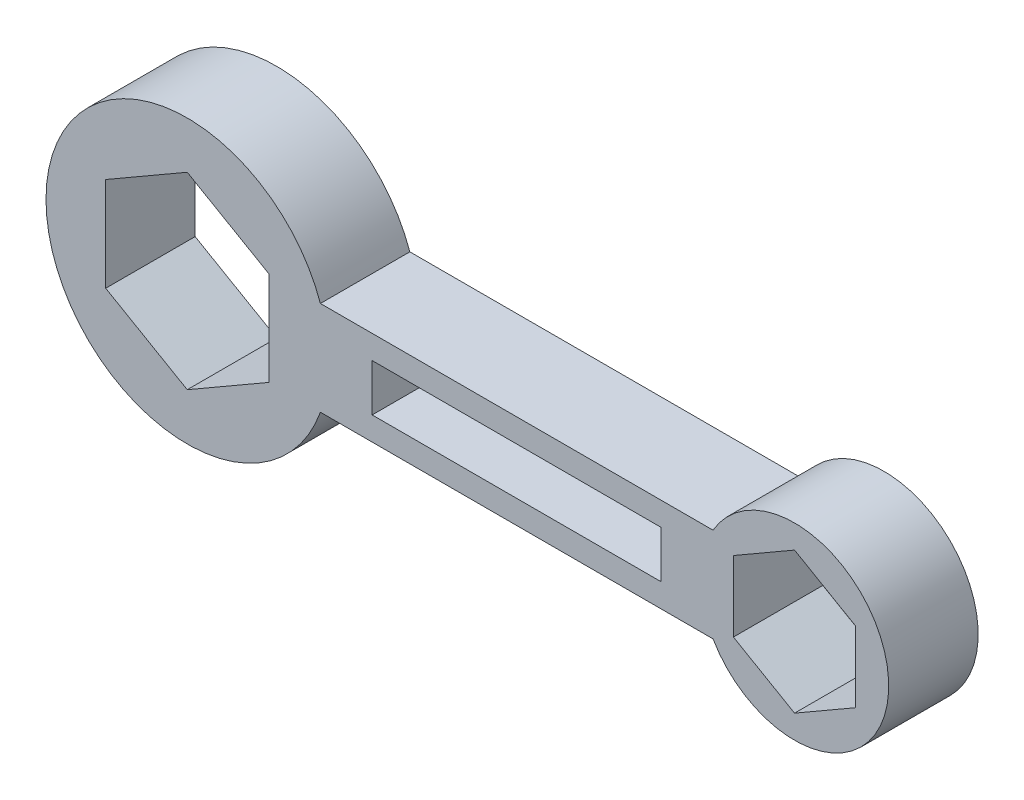
ISO-10303-21;
HEADER;
FILE_DESCRIPTION(('STEP AP214'),'2;1');
FILE_NAME('part.step','',(''),(''),'','','');
FILE_SCHEMA(('AUTOMOTIVE_DESIGN { 1 0 10303 214 1 1 1 1 }'));
ENDSEC;
DATA;
#1=APPLICATION_CONTEXT('core data for automotive mechanical design processes');
#2=APPLICATION_PROTOCOL_DEFINITION('international standard','automotive_design',2000,#1);
#3=PRODUCT_CONTEXT('',#1,'mechanical');
#4=PRODUCT('Part','Part','',(#3));
#5=PRODUCT_RELATED_PRODUCT_CATEGORY('part','',(#4));
#6=PRODUCT_DEFINITION_FORMATION('','',#4);
#7=PRODUCT_DEFINITION_CONTEXT('part definition',#1,'design');
#8=PRODUCT_DEFINITION('design','',#6,#7);
#9=PRODUCT_DEFINITION_SHAPE('','',#8);
#10=(LENGTH_UNIT() NAMED_UNIT(*) SI_UNIT(.MILLI.,.METRE.));
#11=(NAMED_UNIT(*) PLANE_ANGLE_UNIT() SI_UNIT($,.RADIAN.));
#12=(NAMED_UNIT(*) SI_UNIT($,.STERADIAN.) SOLID_ANGLE_UNIT());
#13=UNCERTAINTY_MEASURE_WITH_UNIT(LENGTH_MEASURE(1.E-05),#10,'distance_accuracy_value','');
#14=(GEOMETRIC_REPRESENTATION_CONTEXT(3) GLOBAL_UNCERTAINTY_ASSIGNED_CONTEXT((#13)) GLOBAL_UNIT_ASSIGNED_CONTEXT((#10,
#11,#12)) REPRESENTATION_CONTEXT('',''));
#15=CARTESIAN_POINT('',(0.,0.,0.));
#16=DIRECTION('',(0.,0.,1.));
#17=DIRECTION('',(1.,0.,0.));
#18=AXIS2_PLACEMENT_3D('',#15,#16,#17);
#19=CARTESIAN_POINT('',(-73.3290915102243,-16.3131082037493,19.));
#20=DIRECTION('',(0.,0.,-1.));
#21=DIRECTION('',(-1.,0.,0.));
#22=AXIS2_PLACEMENT_3D('',#19,#20,#21);
#23=CYLINDRICAL_SURFACE('',#22,30.);
#24=CARTESIAN_POINT('',(-73.3290915102243,-16.3131082037493,0.));
#25=DIRECTION('',(0.,0.,1.));
#26=DIRECTION('',(1.,0.,0.));
#27=AXIS2_PLACEMENT_3D('',#24,#25,#26);
#28=CIRCLE('',#27,30.);
#29=CARTESIAN_POINT('',(-45.0448202627624,-6.31310820374927,0.));
#30=VERTEX_POINT('',#29);
#31=CARTESIAN_POINT('',(-45.0448202627624,-26.3131082037493,0.));
#32=VERTEX_POINT('',#31);
#33=EDGE_CURVE('E220',#30,#32,#28,.T.);
#34=ORIENTED_EDGE('',*,*,#33,.T.);
#35=DIRECTION('',(0.,0.,-1.));
#36=VECTOR('',#35,1.);
#37=CARTESIAN_POINT('',(-45.0448202627624,-26.3131082037493,19.));
#38=LINE('',#37,#36);
#39=CARTESIAN_POINT('',(-45.0448202627624,-26.3131082037493,19.));
#40=VERTEX_POINT('',#39);
#41=EDGE_CURVE('E11',#40,#32,#38,.T.);
#42=ORIENTED_EDGE('',*,*,#41,.F.);
#43=CARTESIAN_POINT('',(-73.3290915102243,-16.3131082037493,19.));
#44=DIRECTION('',(0.,0.,1.));
#45=DIRECTION('',(1.,0.,0.));
#46=AXIS2_PLACEMENT_3D('',#43,#44,#45);
#47=CIRCLE('',#46,30.);
#48=CARTESIAN_POINT('',(-45.0448202627624,-6.31310820374927,19.));
#49=VERTEX_POINT('',#48);
#50=EDGE_CURVE('E305',#49,#40,#47,.T.);
#51=ORIENTED_EDGE('',*,*,#50,.F.);
#52=DIRECTION('',(0.,0.,-1.));
#53=VECTOR('',#52,1.);
#54=CARTESIAN_POINT('',(-45.0448202627624,-6.31310820374927,19.));
#55=LINE('',#54,#53);
#56=EDGE_CURVE('E315',#49,#30,#55,.T.);
#57=ORIENTED_EDGE('',*,*,#56,.T.);
#58=EDGE_LOOP('',(#34,#42,#51,#57));
#59=FACE_BOUND('',#58,.T.);
#60=ADVANCED_FACE('F36',(#59),#23,.T.);
#61=CARTESIAN_POINT('',(0.,-26.3131082037493,19.));
#62=DIRECTION('',(0.,-1.,0.));
#63=DIRECTION('',(0.,0.,-1.));
#64=AXIS2_PLACEMENT_3D('',#61,#62,#63);
#65=PLANE('',#64);
#66=DIRECTION('',(-1.,0.,0.));
#67=VECTOR('',#66,1.);
#68=CARTESIAN_POINT('',(0.,-26.3131082037493,0.));
#69=LINE('',#68,#67);
#70=CARTESIAN_POINT('',(38.3504004140869,-26.3131082037493,0.));
#71=VERTEX_POINT('',#70);
#72=EDGE_CURVE('E318',#71,#32,#69,.T.);
#73=ORIENTED_EDGE('',*,*,#72,.F.);
#74=DIRECTION('',(0.,0.,-1.));
#75=VECTOR('',#74,1.);
#76=CARTESIAN_POINT('',(38.3504004140869,-26.3131082037493,19.));
#77=LINE('',#76,#75);
#78=CARTESIAN_POINT('',(38.3504004140869,-26.3131082037493,19.));
#79=VERTEX_POINT('',#78);
#80=EDGE_CURVE('E43',#79,#71,#77,.T.);
#81=ORIENTED_EDGE('',*,*,#80,.F.);
#82=DIRECTION('',(-1.,0.,0.));
#83=VECTOR('',#82,1.);
#84=CARTESIAN_POINT('',(0.,-26.3131082037493,19.));
#85=LINE('',#84,#83);
#86=EDGE_CURVE('E307',#79,#40,#85,.T.);
#87=ORIENTED_EDGE('',*,*,#86,.T.);
#88=ORIENTED_EDGE('',*,*,#41,.T.);
#89=EDGE_LOOP('',(#73,#81,#87,#88));
#90=FACE_BOUND('',#89,.T.);
#91=ADVANCED_FACE('F339',(#90),#65,.T.);
#92=CARTESIAN_POINT('',(55.6709084897757,-16.3131082037493,19.));
#93=DIRECTION('',(0.,0.,-1.));
#94=DIRECTION('',(-1.,0.,0.));
#95=AXIS2_PLACEMENT_3D('',#92,#93,#94);
#96=CYLINDRICAL_SURFACE('',#95,20.);
#97=CARTESIAN_POINT('',(55.6709084897757,-16.3131082037493,0.));
#98=DIRECTION('',(0.,0.,1.));
#99=DIRECTION('',(1.,0.,0.));
#100=AXIS2_PLACEMENT_3D('',#97,#98,#99);
#101=CIRCLE('',#100,20.);
#102=CARTESIAN_POINT('',(38.3504004140869,-6.31310820374927,0.));
#103=VERTEX_POINT('',#102);
#104=EDGE_CURVE('E321',#71,#103,#101,.T.);
#105=ORIENTED_EDGE('',*,*,#104,.T.);
#106=DIRECTION('',(0.,0.,-1.));
#107=VECTOR('',#106,1.);
#108=CARTESIAN_POINT('',(38.3504004140869,-6.31310820374927,19.));
#109=LINE('',#108,#107);
#110=CARTESIAN_POINT('',(38.3504004140869,-6.31310820374927,19.));
#111=VERTEX_POINT('',#110);
#112=EDGE_CURVE('E326',#111,#103,#109,.T.);
#113=ORIENTED_EDGE('',*,*,#112,.F.);
#114=CARTESIAN_POINT('',(55.6709084897757,-16.3131082037493,19.));
#115=DIRECTION('',(0.,0.,1.));
#116=DIRECTION('',(1.,0.,0.));
#117=AXIS2_PLACEMENT_3D('',#114,#115,#116);
#118=CIRCLE('',#117,20.);
#119=EDGE_CURVE('E311',#79,#111,#118,.T.);
#120=ORIENTED_EDGE('',*,*,#119,.F.);
#121=ORIENTED_EDGE('',*,*,#80,.T.);
#122=EDGE_LOOP('',(#105,#113,#120,#121));
#123=FACE_BOUND('',#122,.T.);
#124=ADVANCED_FACE('F331',(#123),#96,.T.);
#125=CARTESIAN_POINT('',(0.,-6.31310820374927,19.));
#126=DIRECTION('',(0.,-1.,0.));
#127=DIRECTION('',(0.,0.,-1.));
#128=AXIS2_PLACEMENT_3D('',#125,#126,#127);
#129=PLANE('',#128);
#130=DIRECTION('',(-1.,0.,0.));
#131=VECTOR('',#130,1.);
#132=CARTESIAN_POINT('',(0.,-6.31310820374927,0.));
#133=LINE('',#132,#131);
#134=EDGE_CURVE('E308',#103,#30,#133,.T.);
#135=ORIENTED_EDGE('',*,*,#134,.T.);
#136=ORIENTED_EDGE('',*,*,#56,.F.);
#137=DIRECTION('',(-1.,0.,0.));
#138=VECTOR('',#137,1.);
#139=CARTESIAN_POINT('',(0.,-6.31310820374927,19.));
#140=LINE('',#139,#138);
#141=EDGE_CURVE('E313',#111,#49,#140,.T.);
#142=ORIENTED_EDGE('',*,*,#141,.F.);
#143=ORIENTED_EDGE('',*,*,#112,.T.);
#144=EDGE_LOOP('',(#135,#136,#142,#143));
#145=FACE_BOUND('',#144,.T.);
#146=ADVANCED_FACE('F346',(#145),#129,.F.);
#147=CARTESIAN_POINT('',(0.,0.,19.));
#148=DIRECTION('',(0.,0.,1.));
#149=DIRECTION('',(1.,0.,0.));
#150=AXIS2_PLACEMENT_3D('',#147,#148,#149);
#151=PLANE('',#150);
#152=DIRECTION('',(-0.866025403784439,0.5,0.));
#153=VECTOR('',#152,1.);
#154=CARTESIAN_POINT('',(-56.0085834345356,-6.31310820374927,19.));
#155=LINE('',#154,#153);
#156=CARTESIAN_POINT('',(-56.0085834345356,-6.31310820374927,19.));
#157=VERTEX_POINT('',#156);
#158=CARTESIAN_POINT('',(-73.3290915102243,3.68689179625073,19.));
#159=VERTEX_POINT('',#158);
#160=EDGE_CURVE('E50',#157,#159,#155,.T.);
#161=ORIENTED_EDGE('',*,*,#160,.F.);
#162=DIRECTION('',(0.,1.,0.));
#163=VECTOR('',#162,1.);
#164=CARTESIAN_POINT('',(-56.0085834345356,-26.3131082037493,19.));
#165=LINE('',#164,#163);
#166=CARTESIAN_POINT('',(-56.0085834345356,-26.3131082037493,19.));
#167=VERTEX_POINT('',#166);
#168=EDGE_CURVE('E193',#167,#157,#165,.T.);
#169=ORIENTED_EDGE('',*,*,#168,.F.);
#170=DIRECTION('',(0.866025403784439,0.5,0.));
#171=VECTOR('',#170,1.);
#172=CARTESIAN_POINT('',(-73.3290915102243,-36.3131082037493,19.));
#173=LINE('',#172,#171);
#174=CARTESIAN_POINT('',(-73.3290915102243,-36.3131082037493,19.));
#175=VERTEX_POINT('',#174);
#176=EDGE_CURVE('E196',#175,#167,#173,.T.);
#177=ORIENTED_EDGE('',*,*,#176,.F.);
#178=DIRECTION('',(0.866025403784439,-0.5,0.));
#179=VECTOR('',#178,1.);
#180=CARTESIAN_POINT('',(-90.6495995859131,-26.3131082037493,19.));
#181=LINE('',#180,#179);
#182=CARTESIAN_POINT('',(-90.6495995859131,-26.3131082037493,19.));
#183=VERTEX_POINT('',#182);
#184=EDGE_CURVE('E213',#183,#175,#181,.T.);
#185=ORIENTED_EDGE('',*,*,#184,.F.);
#186=DIRECTION('',(0.,-1.,0.));
#187=VECTOR('',#186,1.);
#188=CARTESIAN_POINT('',(-90.6495995859131,-6.31310820374927,19.));
#189=LINE('',#188,#187);
#190=CARTESIAN_POINT('',(-90.6495995859131,-6.31310820374927,19.));
#191=VERTEX_POINT('',#190);
#192=EDGE_CURVE('E210',#191,#183,#189,.T.);
#193=ORIENTED_EDGE('',*,*,#192,.F.);
#194=DIRECTION('',(-0.866025403784439,-0.5,0.));
#195=VECTOR('',#194,1.);
#196=CARTESIAN_POINT('',(-73.3290915102243,3.68689179625073,19.));
#197=LINE('',#196,#195);
#198=EDGE_CURVE('E207',#159,#191,#197,.T.);
#199=ORIENTED_EDGE('',*,*,#198,.F.);
#200=EDGE_LOOP('',(#161,#169,#177,#185,#193,#199));
#201=FACE_BOUND('',#200,.T.);
#202=DIRECTION('',(-0.866025403784439,0.5,0.));
#203=VECTOR('',#202,1.);
#204=CARTESIAN_POINT('',(68.6612895465422,-8.81310820374926,19.));
#205=LINE('',#204,#203);
#206=CARTESIAN_POINT('',(68.6612895465422,-8.81310820374926,19.));
#207=VERTEX_POINT('',#206);
#208=CARTESIAN_POINT('',(55.6709084897757,-1.31310820374927,19.));
#209=VERTEX_POINT('',#208);
#210=EDGE_CURVE('E58',#207,#209,#205,.T.);
#211=ORIENTED_EDGE('',*,*,#210,.F.);
#212=DIRECTION('',(0.,1.,0.));
#213=VECTOR('',#212,1.);
#214=CARTESIAN_POINT('',(68.6612895465422,-23.8131082037493,19.));
#215=LINE('',#214,#213);
#216=CARTESIAN_POINT('',(68.6612895465422,-23.8131082037493,19.));
#217=VERTEX_POINT('',#216);
#218=EDGE_CURVE('E232',#217,#207,#215,.T.);
#219=ORIENTED_EDGE('',*,*,#218,.F.);
#220=DIRECTION('',(0.866025403784438,0.5,0.));
#221=VECTOR('',#220,1.);
#222=CARTESIAN_POINT('',(55.6709084897757,-31.3131082037493,19.));
#223=LINE('',#222,#221);
#224=CARTESIAN_POINT('',(55.6709084897757,-31.3131082037493,19.));
#225=VERTEX_POINT('',#224);
#226=EDGE_CURVE('E259',#225,#217,#223,.T.);
#227=ORIENTED_EDGE('',*,*,#226,.F.);
#228=DIRECTION('',(0.866025403784438,-0.5,0.));
#229=VECTOR('',#228,1.);
#230=CARTESIAN_POINT('',(42.6805274330091,-23.8131082037493,19.));
#231=LINE('',#230,#229);
#232=CARTESIAN_POINT('',(42.6805274330091,-23.8131082037493,19.));
#233=VERTEX_POINT('',#232);
#234=EDGE_CURVE('E256',#233,#225,#231,.T.);
#235=ORIENTED_EDGE('',*,*,#234,.F.);
#236=DIRECTION('',(0.,-1.,0.));
#237=VECTOR('',#236,1.);
#238=CARTESIAN_POINT('',(42.6805274330091,-8.81310820374927,19.));
#239=LINE('',#238,#237);
#240=CARTESIAN_POINT('',(42.6805274330091,-8.81310820374927,19.));
#241=VERTEX_POINT('',#240);
#242=EDGE_CURVE('E253',#241,#233,#239,.T.);
#243=ORIENTED_EDGE('',*,*,#242,.F.);
#244=DIRECTION('',(-0.866025403784438,-0.5,0.));
#245=VECTOR('',#244,1.);
#246=CARTESIAN_POINT('',(55.6709084897757,-1.31310820374927,19.));
#247=LINE('',#246,#245);
#248=EDGE_CURVE('E249',#209,#241,#247,.T.);
#249=ORIENTED_EDGE('',*,*,#248,.F.);
#250=EDGE_LOOP('',(#211,#219,#227,#235,#243,#249));
#251=FACE_BOUND('',#250,.T.);
#252=DIRECTION('',(0.,-1.,0.));
#253=VECTOR('',#252,1.);
#254=CARTESIAN_POINT('',(-34.0448202627624,-11.3131082037493,19.));
#255=LINE('',#254,#253);
#256=CARTESIAN_POINT('',(-34.0448202627624,-11.3131082037493,19.));
#257=VERTEX_POINT('',#256);
#258=CARTESIAN_POINT('',(-34.0448202627624,-21.3131082037493,19.));
#259=VERTEX_POINT('',#258);
#260=EDGE_CURVE('E288',#257,#259,#255,.T.);
#261=ORIENTED_EDGE('',*,*,#260,.F.);
#262=DIRECTION('',(-1.,0.,0.));
#263=VECTOR('',#262,1.);
#264=CARTESIAN_POINT('',(-34.0448202627624,-11.3131082037493,19.));
#265=LINE('',#264,#263);
#266=CARTESIAN_POINT('',(27.3504004140869,-11.3131082037493,19.));
#267=VERTEX_POINT('',#266);
#268=EDGE_CURVE('E278',#267,#257,#265,.T.);
#269=ORIENTED_EDGE('',*,*,#268,.F.);
#270=DIRECTION('',(0.,1.,0.));
#271=VECTOR('',#270,1.);
#272=CARTESIAN_POINT('',(27.3504004140869,-11.3131082037493,19.));
#273=LINE('',#272,#271);
#274=CARTESIAN_POINT('',(27.3504004140869,-21.3131082037493,19.));
#275=VERTEX_POINT('',#274);
#276=EDGE_CURVE('E293',#275,#267,#273,.T.);
#277=ORIENTED_EDGE('',*,*,#276,.F.);
#278=DIRECTION('',(1.,0.,0.));
#279=VECTOR('',#278,1.);
#280=CARTESIAN_POINT('',(-34.0448202627624,-21.3131082037493,19.));
#281=LINE('',#280,#279);
#282=EDGE_CURVE('E290',#259,#275,#281,.T.);
#283=ORIENTED_EDGE('',*,*,#282,.F.);
#284=EDGE_LOOP('',(#261,#269,#277,#283));
#285=FACE_BOUND('',#284,.T.);
#286=ORIENTED_EDGE('',*,*,#50,.T.);
#287=ORIENTED_EDGE('',*,*,#86,.F.);
#288=ORIENTED_EDGE('',*,*,#119,.T.);
#289=ORIENTED_EDGE('',*,*,#141,.T.);
#290=EDGE_LOOP('',(#286,#287,#288,#289));
#291=FACE_BOUND('',#290,.T.);
#292=ADVANCED_FACE('F348',(#201,#251,#285,#291),#151,.T.);
#293=CARTESIAN_POINT('',(0.,0.,0.));
#294=DIRECTION('',(0.,0.,1.));
#295=DIRECTION('',(1.,0.,0.));
#296=AXIS2_PLACEMENT_3D('',#293,#294,#295);
#297=PLANE('',#296);
#298=DIRECTION('',(0.,1.,0.));
#299=VECTOR('',#298,1.);
#300=CARTESIAN_POINT('',(-56.0085834345356,-26.3131082037493,0.));
#301=LINE('',#300,#299);
#302=CARTESIAN_POINT('',(-56.0085834345356,-26.3131082037493,0.));
#303=VERTEX_POINT('',#302);
#304=CARTESIAN_POINT('',(-56.0085834345356,-6.31310820374927,0.));
#305=VERTEX_POINT('',#304);
#306=EDGE_CURVE('E179',#303,#305,#301,.T.);
#307=ORIENTED_EDGE('',*,*,#306,.T.);
#308=DIRECTION('',(-0.866025403784439,0.5,0.));
#309=VECTOR('',#308,1.);
#310=CARTESIAN_POINT('',(-56.0085834345356,-6.31310820374927,0.));
#311=LINE('',#310,#309);
#312=CARTESIAN_POINT('',(-73.3290915102243,3.68689179625073,0.));
#313=VERTEX_POINT('',#312);
#314=EDGE_CURVE('E173',#305,#313,#311,.T.);
#315=ORIENTED_EDGE('',*,*,#314,.T.);
#316=DIRECTION('',(-0.866025403784439,-0.5,0.));
#317=VECTOR('',#316,1.);
#318=CARTESIAN_POINT('',(-73.3290915102243,3.68689179625073,0.));
#319=LINE('',#318,#317);
#320=CARTESIAN_POINT('',(-90.6495995859131,-6.31310820374927,0.));
#321=VERTEX_POINT('',#320);
#322=EDGE_CURVE('E183',#313,#321,#319,.T.);
#323=ORIENTED_EDGE('',*,*,#322,.T.);
#324=DIRECTION('',(0.,-1.,0.));
#325=VECTOR('',#324,1.);
#326=CARTESIAN_POINT('',(-90.6495995859131,-6.31310820374927,0.));
#327=LINE('',#326,#325);
#328=CARTESIAN_POINT('',(-90.6495995859131,-26.3131082037493,0.));
#329=VERTEX_POINT('',#328);
#330=EDGE_CURVE('E187',#321,#329,#327,.T.);
#331=ORIENTED_EDGE('',*,*,#330,.T.);
#332=DIRECTION('',(0.866025403784439,-0.5,0.));
#333=VECTOR('',#332,1.);
#334=CARTESIAN_POINT('',(-90.6495995859131,-26.3131082037493,0.));
#335=LINE('',#334,#333);
#336=CARTESIAN_POINT('',(-73.3290915102243,-36.3131082037493,0.));
#337=VERTEX_POINT('',#336);
#338=EDGE_CURVE('E200',#329,#337,#335,.T.);
#339=ORIENTED_EDGE('',*,*,#338,.T.);
#340=DIRECTION('',(0.866025403784439,0.5,0.));
#341=VECTOR('',#340,1.);
#342=CARTESIAN_POINT('',(-73.3290915102243,-36.3131082037493,0.));
#343=LINE('',#342,#341);
#344=EDGE_CURVE('E203',#337,#303,#343,.T.);
#345=ORIENTED_EDGE('',*,*,#344,.T.);
#346=EDGE_LOOP('',(#307,#315,#323,#331,#339,#345));
#347=FACE_BOUND('',#346,.T.);
#348=DIRECTION('',(0.,1.,0.));
#349=VECTOR('',#348,1.);
#350=CARTESIAN_POINT('',(68.6612895465422,-23.8131082037493,0.));
#351=LINE('',#350,#349);
#352=CARTESIAN_POINT('',(68.6612895465422,-23.8131082037493,0.));
#353=VERTEX_POINT('',#352);
#354=CARTESIAN_POINT('',(68.6612895465422,-8.81310820374926,0.));
#355=VERTEX_POINT('',#354);
#356=EDGE_CURVE('E244',#353,#355,#351,.T.);
#357=ORIENTED_EDGE('',*,*,#356,.T.);
#358=DIRECTION('',(-0.866025403784439,0.5,0.));
#359=VECTOR('',#358,1.);
#360=CARTESIAN_POINT('',(68.6612895465422,-8.81310820374926,0.));
#361=LINE('',#360,#359);
#362=CARTESIAN_POINT('',(55.6709084897757,-1.31310820374927,0.));
#363=VERTEX_POINT('',#362);
#364=EDGE_CURVE('E228',#355,#363,#361,.T.);
#365=ORIENTED_EDGE('',*,*,#364,.T.);
#366=DIRECTION('',(-0.866025403784438,-0.5,0.));
#367=VECTOR('',#366,1.);
#368=CARTESIAN_POINT('',(55.6709084897757,-1.31310820374927,0.));
#369=LINE('',#368,#367);
#370=CARTESIAN_POINT('',(42.6805274330091,-8.81310820374928,0.));
#371=VERTEX_POINT('',#370);
#372=EDGE_CURVE('E231',#363,#371,#369,.T.);
#373=ORIENTED_EDGE('',*,*,#372,.T.);
#374=DIRECTION('',(0.,-1.,0.));
#375=VECTOR('',#374,1.);
#376=CARTESIAN_POINT('',(42.6805274330091,-8.81310820374927,0.));
#377=LINE('',#376,#375);
#378=CARTESIAN_POINT('',(42.6805274330091,-23.8131082037493,0.));
#379=VERTEX_POINT('',#378);
#380=EDGE_CURVE('E235',#371,#379,#377,.T.);
#381=ORIENTED_EDGE('',*,*,#380,.T.);
#382=DIRECTION('',(0.866025403784438,-0.5,0.));
#383=VECTOR('',#382,1.);
#384=CARTESIAN_POINT('',(42.6805274330091,-23.8131082037493,0.));
#385=LINE('',#384,#383);
#386=CARTESIAN_POINT('',(55.6709084897757,-31.3131082037493,0.));
#387=VERTEX_POINT('',#386);
#388=EDGE_CURVE('E238',#379,#387,#385,.T.);
#389=ORIENTED_EDGE('',*,*,#388,.T.);
#390=DIRECTION('',(0.866025403784438,0.5,0.));
#391=VECTOR('',#390,1.);
#392=CARTESIAN_POINT('',(55.6709084897757,-31.3131082037493,0.));
#393=LINE('',#392,#391);
#394=EDGE_CURVE('E241',#387,#353,#393,.T.);
#395=ORIENTED_EDGE('',*,*,#394,.T.);
#396=EDGE_LOOP('',(#357,#365,#373,#381,#389,#395));
#397=FACE_BOUND('',#396,.T.);
#398=DIRECTION('',(-1.,0.,0.));
#399=VECTOR('',#398,1.);
#400=CARTESIAN_POINT('',(-34.0448202627624,-11.3131082037493,0.));
#401=LINE('',#400,#399);
#402=CARTESIAN_POINT('',(27.3504004140869,-11.3131082037493,0.));
#403=VERTEX_POINT('',#402);
#404=CARTESIAN_POINT('',(-34.0448202627624,-11.3131082037493,0.));
#405=VERTEX_POINT('',#404);
#406=EDGE_CURVE('E284',#403,#405,#401,.T.);
#407=ORIENTED_EDGE('',*,*,#406,.T.);
#408=DIRECTION('',(0.,-1.,0.));
#409=VECTOR('',#408,1.);
#410=CARTESIAN_POINT('',(-34.0448202627624,-11.3131082037493,0.));
#411=LINE('',#410,#409);
#412=CARTESIAN_POINT('',(-34.0448202627624,-21.3131082037493,0.));
#413=VERTEX_POINT('',#412);
#414=EDGE_CURVE('E274',#405,#413,#411,.T.);
#415=ORIENTED_EDGE('',*,*,#414,.T.);
#416=DIRECTION('',(1.,0.,0.));
#417=VECTOR('',#416,1.);
#418=CARTESIAN_POINT('',(-34.0448202627624,-21.3131082037493,0.));
#419=LINE('',#418,#417);
#420=CARTESIAN_POINT('',(27.3504004140869,-21.3131082037493,0.));
#421=VERTEX_POINT('',#420);
#422=EDGE_CURVE('E277',#413,#421,#419,.T.);
#423=ORIENTED_EDGE('',*,*,#422,.T.);
#424=DIRECTION('',(0.,1.,0.));
#425=VECTOR('',#424,1.);
#426=CARTESIAN_POINT('',(27.3504004140869,-11.3131082037493,0.));
#427=LINE('',#426,#425);
#428=EDGE_CURVE('E281',#421,#403,#427,.T.);
#429=ORIENTED_EDGE('',*,*,#428,.T.);
#430=EDGE_LOOP('',(#407,#415,#423,#429));
#431=FACE_BOUND('',#430,.T.);
#432=ORIENTED_EDGE('',*,*,#33,.F.);
#433=ORIENTED_EDGE('',*,*,#134,.F.);
#434=ORIENTED_EDGE('',*,*,#104,.F.);
#435=ORIENTED_EDGE('',*,*,#72,.T.);
#436=EDGE_LOOP('',(#432,#433,#434,#435));
#437=FACE_BOUND('',#436,.T.);
#438=ADVANCED_FACE('F189',(#347,#397,#431,#437),#297,.F.);
#439=CARTESIAN_POINT('',(-34.0448202627624,-11.3131082037493,0.));
#440=DIRECTION('',(-1.,0.,0.));
#441=DIRECTION('',(0.,0.,1.));
#442=AXIS2_PLACEMENT_3D('',#439,#440,#441);
#443=PLANE('',#442);
#444=ORIENTED_EDGE('',*,*,#260,.T.);
#445=DIRECTION('',(0.,0.,1.));
#446=VECTOR('',#445,1.);
#447=CARTESIAN_POINT('',(-34.0448202627624,-21.3131082037493,0.));
#448=LINE('',#447,#446);
#449=EDGE_CURVE('E287',#413,#259,#448,.T.);
#450=ORIENTED_EDGE('',*,*,#449,.F.);
#451=ORIENTED_EDGE('',*,*,#414,.F.);
#452=DIRECTION('',(0.,0.,1.));
#453=VECTOR('',#452,1.);
#454=CARTESIAN_POINT('',(-34.0448202627624,-11.3131082037493,0.));
#455=LINE('',#454,#453);
#456=EDGE_CURVE('E250',#405,#257,#455,.T.);
#457=ORIENTED_EDGE('',*,*,#456,.T.);
#458=EDGE_LOOP('',(#444,#450,#451,#457));
#459=FACE_BOUND('',#458,.T.);
#460=ADVANCED_FACE('F356',(#459),#443,.F.);
#461=CARTESIAN_POINT('',(-34.0448202627624,-11.3131082037493,0.));
#462=DIRECTION('',(0.,1.,0.));
#463=DIRECTION('',(0.,0.,1.));
#464=AXIS2_PLACEMENT_3D('',#461,#462,#463);
#465=PLANE('',#464);
#466=ORIENTED_EDGE('',*,*,#268,.T.);
#467=ORIENTED_EDGE('',*,*,#456,.F.);
#468=ORIENTED_EDGE('',*,*,#406,.F.);
#469=DIRECTION('',(0.,0.,1.));
#470=VECTOR('',#469,1.);
#471=CARTESIAN_POINT('',(27.3504004140869,-11.3131082037493,0.));
#472=LINE('',#471,#470);
#473=EDGE_CURVE('E299',#403,#267,#472,.T.);
#474=ORIENTED_EDGE('',*,*,#473,.T.);
#475=EDGE_LOOP('',(#466,#467,#468,#474));
#476=FACE_BOUND('',#475,.T.);
#477=ADVANCED_FACE('F389',(#476),#465,.F.);
#478=CARTESIAN_POINT('',(27.3504004140869,-11.3131082037493,0.));
#479=DIRECTION('',(1.,0.,0.));
#480=DIRECTION('',(0.,0.,-1.));
#481=AXIS2_PLACEMENT_3D('',#478,#479,#480);
#482=PLANE('',#481);
#483=ORIENTED_EDGE('',*,*,#276,.T.);
#484=ORIENTED_EDGE('',*,*,#473,.F.);
#485=ORIENTED_EDGE('',*,*,#428,.F.);
#486=DIRECTION('',(0.,0.,1.));
#487=VECTOR('',#486,1.);
#488=CARTESIAN_POINT('',(27.3504004140869,-21.3131082037493,0.));
#489=LINE('',#488,#487);
#490=EDGE_CURVE('E301',#421,#275,#489,.T.);
#491=ORIENTED_EDGE('',*,*,#490,.T.);
#492=EDGE_LOOP('',(#483,#484,#485,#491));
#493=FACE_BOUND('',#492,.T.);
#494=ADVANCED_FACE('F396',(#493),#482,.F.);
#495=CARTESIAN_POINT('',(-34.0448202627624,-21.3131082037493,0.));
#496=DIRECTION('',(0.,-1.,0.));
#497=DIRECTION('',(0.,0.,-1.));
#498=AXIS2_PLACEMENT_3D('',#495,#496,#497);
#499=PLANE('',#498);
#500=ORIENTED_EDGE('',*,*,#282,.T.);
#501=ORIENTED_EDGE('',*,*,#490,.F.);
#502=ORIENTED_EDGE('',*,*,#422,.F.);
#503=ORIENTED_EDGE('',*,*,#449,.T.);
#504=EDGE_LOOP('',(#500,#501,#502,#503));
#505=FACE_BOUND('',#504,.T.);
#506=ADVANCED_FACE('F404',(#505),#499,.F.);
#507=CARTESIAN_POINT('',(68.6612895465422,-8.81310820374926,0.));
#508=DIRECTION('',(0.5,0.866025403784439,0.));
#509=DIRECTION('',(-0.866025403784439,0.5,0.));
#510=AXIS2_PLACEMENT_3D('',#507,#508,#509);
#511=PLANE('',#510);
#512=ORIENTED_EDGE('',*,*,#210,.T.);
#513=DIRECTION('',(0.,0.,1.));
#514=VECTOR('',#513,1.);
#515=CARTESIAN_POINT('',(55.6709084897757,-1.31310820374927,0.));
#516=LINE('',#515,#514);
#517=EDGE_CURVE('E247',#363,#209,#516,.T.);
#518=ORIENTED_EDGE('',*,*,#517,.F.);
#519=ORIENTED_EDGE('',*,*,#364,.F.);
#520=DIRECTION('',(0.,0.,1.));
#521=VECTOR('',#520,1.);
#522=CARTESIAN_POINT('',(68.6612895465422,-8.81310820374926,0.));
#523=LINE('',#522,#521);
#524=EDGE_CURVE('E208',#355,#207,#523,.T.);
#525=ORIENTED_EDGE('',*,*,#524,.T.);
#526=EDGE_LOOP('',(#512,#518,#519,#525));
#527=FACE_BOUND('',#526,.T.);
#528=ADVANCED_FACE('F412',(#527),#511,.F.);
#529=CARTESIAN_POINT('',(68.6612895465422,-23.8131082037493,0.));
#530=DIRECTION('',(1.,0.,0.));
#531=DIRECTION('',(0.,0.,-1.));
#532=AXIS2_PLACEMENT_3D('',#529,#530,#531);
#533=PLANE('',#532);
#534=ORIENTED_EDGE('',*,*,#218,.T.);
#535=ORIENTED_EDGE('',*,*,#524,.F.);
#536=ORIENTED_EDGE('',*,*,#356,.F.);
#537=DIRECTION('',(0.,0.,1.));
#538=VECTOR('',#537,1.);
#539=CARTESIAN_POINT('',(68.6612895465422,-23.8131082037493,0.));
#540=LINE('',#539,#538);
#541=EDGE_CURVE('E265',#353,#217,#540,.T.);
#542=ORIENTED_EDGE('',*,*,#541,.T.);
#543=EDGE_LOOP('',(#534,#535,#536,#542));
#544=FACE_BOUND('',#543,.T.);
#545=ADVANCED_FACE('F420',(#544),#533,.F.);
#546=CARTESIAN_POINT('',(55.6709084897757,-31.3131082037493,0.));
#547=DIRECTION('',(0.5,-0.866025403784438,0.));
#548=DIRECTION('',(0.866025403784438,0.500000000000001,0.));
#549=AXIS2_PLACEMENT_3D('',#546,#547,#548);
#550=PLANE('',#549);
#551=ORIENTED_EDGE('',*,*,#226,.T.);
#552=ORIENTED_EDGE('',*,*,#541,.F.);
#553=ORIENTED_EDGE('',*,*,#394,.F.);
#554=DIRECTION('',(0.,0.,1.));
#555=VECTOR('',#554,1.);
#556=CARTESIAN_POINT('',(55.6709084897757,-31.3131082037493,0.));
#557=LINE('',#556,#555);
#558=EDGE_CURVE('E267',#387,#225,#557,.T.);
#559=ORIENTED_EDGE('',*,*,#558,.T.);
#560=EDGE_LOOP('',(#551,#552,#553,#559));
#561=FACE_BOUND('',#560,.T.);
#562=ADVANCED_FACE('F427',(#561),#550,.F.);
#563=CARTESIAN_POINT('',(42.6805274330091,-23.8131082037493,0.));
#564=DIRECTION('',(-0.5,-0.866025403784438,0.));
#565=DIRECTION('',(0.866025403784439,-0.5,0.));
#566=AXIS2_PLACEMENT_3D('',#563,#564,#565);
#567=PLANE('',#566);
#568=ORIENTED_EDGE('',*,*,#234,.T.);
#569=ORIENTED_EDGE('',*,*,#558,.F.);
#570=ORIENTED_EDGE('',*,*,#388,.F.);
#571=DIRECTION('',(0.,0.,1.));
#572=VECTOR('',#571,1.);
#573=CARTESIAN_POINT('',(42.6805274330091,-23.8131082037493,0.));
#574=LINE('',#573,#572);
#575=EDGE_CURVE('E269',#379,#233,#574,.T.);
#576=ORIENTED_EDGE('',*,*,#575,.T.);
#577=EDGE_LOOP('',(#568,#569,#570,#576));
#578=FACE_BOUND('',#577,.T.);
#579=ADVANCED_FACE('F435',(#578),#567,.F.);
#580=CARTESIAN_POINT('',(42.6805274330091,-8.81310820374927,0.));
#581=DIRECTION('',(-1.,0.,0.));
#582=DIRECTION('',(0.,-1.,0.));
#583=AXIS2_PLACEMENT_3D('',#580,#581,#582);
#584=PLANE('',#583);
#585=ORIENTED_EDGE('',*,*,#242,.T.);
#586=ORIENTED_EDGE('',*,*,#575,.F.);
#587=ORIENTED_EDGE('',*,*,#380,.F.);
#588=DIRECTION('',(0.,0.,1.));
#589=VECTOR('',#588,1.);
#590=CARTESIAN_POINT('',(42.6805274330091,-8.81310820374927,0.));
#591=LINE('',#590,#589);
#592=EDGE_CURVE('E271',#371,#241,#591,.T.);
#593=ORIENTED_EDGE('',*,*,#592,.T.);
#594=EDGE_LOOP('',(#585,#586,#587,#593));
#595=FACE_BOUND('',#594,.T.);
#596=ADVANCED_FACE('F443',(#595),#584,.F.);
#597=CARTESIAN_POINT('',(55.6709084897757,-1.31310820374927,0.));
#598=DIRECTION('',(-0.5,0.866025403784439,0.));
#599=DIRECTION('',(-0.866025403784438,-0.5,0.));
#600=AXIS2_PLACEMENT_3D('',#597,#598,#599);
#601=PLANE('',#600);
#602=ORIENTED_EDGE('',*,*,#248,.T.);
#603=ORIENTED_EDGE('',*,*,#592,.F.);
#604=ORIENTED_EDGE('',*,*,#372,.F.);
#605=ORIENTED_EDGE('',*,*,#517,.T.);
#606=EDGE_LOOP('',(#602,#603,#604,#605));
#607=FACE_BOUND('',#606,.T.);
#608=ADVANCED_FACE('F451',(#607),#601,.F.);
#609=CARTESIAN_POINT('',(-56.0085834345356,-6.31310820374927,0.));
#610=DIRECTION('',(0.5,0.866025403784439,0.));
#611=DIRECTION('',(-0.866025403784439,0.5,0.));
#612=AXIS2_PLACEMENT_3D('',#609,#610,#611);
#613=PLANE('',#612);
#614=ORIENTED_EDGE('',*,*,#160,.T.);
#615=DIRECTION('',(0.,0.,1.));
#616=VECTOR('',#615,1.);
#617=CARTESIAN_POINT('',(-73.3290915102243,3.68689179625073,0.));
#618=LINE('',#617,#616);
#619=EDGE_CURVE('E169',#313,#159,#618,.T.);
#620=ORIENTED_EDGE('',*,*,#619,.F.);
#621=ORIENTED_EDGE('',*,*,#314,.F.);
#622=DIRECTION('',(0.,0.,1.));
#623=VECTOR('',#622,1.);
#624=CARTESIAN_POINT('',(-56.0085834345356,-6.31310820374927,0.));
#625=LINE('',#624,#623);
#626=EDGE_CURVE('E218',#305,#157,#625,.T.);
#627=ORIENTED_EDGE('',*,*,#626,.T.);
#628=EDGE_LOOP('',(#614,#620,#621,#627));
#629=FACE_BOUND('',#628,.T.);
#630=ADVANCED_FACE('F171',(#629),#613,.F.);
#631=CARTESIAN_POINT('',(-56.0085834345356,-26.3131082037493,0.));
#632=DIRECTION('',(1.,0.,0.));
#633=DIRECTION('',(0.,1.,0.));
#634=AXIS2_PLACEMENT_3D('',#631,#632,#633);
#635=PLANE('',#634);
#636=ORIENTED_EDGE('',*,*,#168,.T.);
#637=ORIENTED_EDGE('',*,*,#626,.F.);
#638=ORIENTED_EDGE('',*,*,#306,.F.);
#639=DIRECTION('',(0.,0.,1.));
#640=VECTOR('',#639,1.);
#641=CARTESIAN_POINT('',(-56.0085834345356,-26.3131082037493,0.));
#642=LINE('',#641,#640);
#643=EDGE_CURVE('E221',#303,#167,#642,.T.);
#644=ORIENTED_EDGE('',*,*,#643,.T.);
#645=EDGE_LOOP('',(#636,#637,#638,#644));
#646=FACE_BOUND('',#645,.T.);
#647=ADVANCED_FACE('F466',(#646),#635,.F.);
#648=CARTESIAN_POINT('',(-73.3290915102243,-36.3131082037493,0.));
#649=DIRECTION('',(0.5,-0.866025403784439,0.));
#650=DIRECTION('',(0.866025403784438,0.5,0.));
#651=AXIS2_PLACEMENT_3D('',#648,#649,#650);
#652=PLANE('',#651);
#653=ORIENTED_EDGE('',*,*,#176,.T.);
#654=ORIENTED_EDGE('',*,*,#643,.F.);
#655=ORIENTED_EDGE('',*,*,#344,.F.);
#656=DIRECTION('',(0.,0.,1.));
#657=VECTOR('',#656,1.);
#658=CARTESIAN_POINT('',(-73.3290915102243,-36.3131082037493,0.));
#659=LINE('',#658,#657);
#660=EDGE_CURVE('E223',#337,#175,#659,.T.);
#661=ORIENTED_EDGE('',*,*,#660,.T.);
#662=EDGE_LOOP('',(#653,#654,#655,#661));
#663=FACE_BOUND('',#662,.T.);
#664=ADVANCED_FACE('F473',(#663),#652,.F.);
#665=CARTESIAN_POINT('',(-90.6495995859131,-26.3131082037493,0.));
#666=DIRECTION('',(-0.5,-0.866025403784439,0.));
#667=DIRECTION('',(0.866025403784438,-0.5,0.));
#668=AXIS2_PLACEMENT_3D('',#665,#666,#667);
#669=PLANE('',#668);
#670=ORIENTED_EDGE('',*,*,#184,.T.);
#671=ORIENTED_EDGE('',*,*,#660,.F.);
#672=ORIENTED_EDGE('',*,*,#338,.F.);
#673=DIRECTION('',(0.,0.,1.));
#674=VECTOR('',#673,1.);
#675=CARTESIAN_POINT('',(-90.6495995859131,-26.3131082037493,0.));
#676=LINE('',#675,#674);
#677=EDGE_CURVE('E225',#329,#183,#676,.T.);
#678=ORIENTED_EDGE('',*,*,#677,.T.);
#679=EDGE_LOOP('',(#670,#671,#672,#678));
#680=FACE_BOUND('',#679,.T.);
#681=ADVANCED_FACE('F481',(#680),#669,.F.);
#682=CARTESIAN_POINT('',(-90.6495995859131,-6.31310820374927,0.));
#683=DIRECTION('',(-1.,0.,0.));
#684=DIRECTION('',(0.,-1.,0.));
#685=AXIS2_PLACEMENT_3D('',#682,#683,#684);
#686=PLANE('',#685);
#687=ORIENTED_EDGE('',*,*,#192,.T.);
#688=ORIENTED_EDGE('',*,*,#677,.F.);
#689=ORIENTED_EDGE('',*,*,#330,.F.);
#690=DIRECTION('',(0.,0.,1.));
#691=VECTOR('',#690,1.);
#692=CARTESIAN_POINT('',(-90.6495995859131,-6.31310820374927,0.));
#693=LINE('',#692,#691);
#694=EDGE_CURVE('E178',#321,#191,#693,.T.);
#695=ORIENTED_EDGE('',*,*,#694,.T.);
#696=EDGE_LOOP('',(#687,#688,#689,#695));
#697=FACE_BOUND('',#696,.T.);
#698=ADVANCED_FACE('F489',(#697),#686,.F.);
#699=CARTESIAN_POINT('',(-73.3290915102243,3.68689179625073,0.));
#700=DIRECTION('',(-0.5,0.866025403784439,0.));
#701=DIRECTION('',(-0.866025403784438,-0.5,0.));
#702=AXIS2_PLACEMENT_3D('',#699,#700,#701);
#703=PLANE('',#702);
#704=ORIENTED_EDGE('',*,*,#198,.T.);
#705=ORIENTED_EDGE('',*,*,#694,.F.);
#706=ORIENTED_EDGE('',*,*,#322,.F.);
#707=ORIENTED_EDGE('',*,*,#619,.T.);
#708=EDGE_LOOP('',(#704,#705,#706,#707));
#709=FACE_BOUND('',#708,.T.);
#710=ADVANCED_FACE('F184',(#709),#703,.F.);
#711=CLOSED_SHELL('',(#60,#91,#124,#146,#292,#438,#460,#477,#494,#506,#528,#545,#562,#579,#596,
#608,#630,#647,#664,#681,#698,#710));
#712=MANIFOLD_SOLID_BREP('B2',#711);
#713=ADVANCED_BREP_SHAPE_REPRESENTATION('',(#18,#712),#14);
#714=SHAPE_DEFINITION_REPRESENTATION(#9,#713);
ENDSEC;
END-ISO-10303-21;
